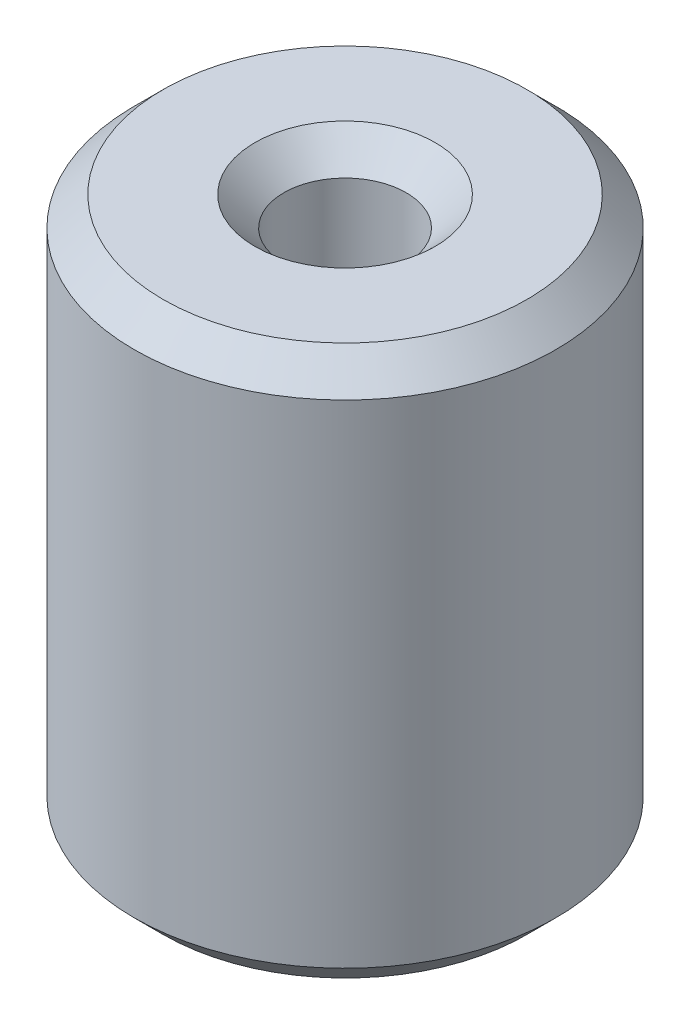
ISO-10303-21;
HEADER;
FILE_DESCRIPTION(('STEP AP214'),'2;1');
FILE_NAME('part.step','',(''),(''),'','','');
FILE_SCHEMA(('AUTOMOTIVE_DESIGN { 1 0 10303 214 1 1 1 1 }'));
ENDSEC;
DATA;
#1=APPLICATION_CONTEXT('core data for automotive mechanical design processes');
#2=APPLICATION_PROTOCOL_DEFINITION('international standard','automotive_design',2000,#1);
#3=PRODUCT_CONTEXT('',#1,'mechanical');
#4=PRODUCT('Part','Part','',(#3));
#5=PRODUCT_RELATED_PRODUCT_CATEGORY('part','',(#4));
#6=PRODUCT_DEFINITION_FORMATION('','',#4);
#7=PRODUCT_DEFINITION_CONTEXT('part definition',#1,'design');
#8=PRODUCT_DEFINITION('design','',#6,#7);
#9=PRODUCT_DEFINITION_SHAPE('','',#8);
#10=(LENGTH_UNIT() NAMED_UNIT(*) SI_UNIT(.MILLI.,.METRE.));
#11=(NAMED_UNIT(*) PLANE_ANGLE_UNIT() SI_UNIT($,.RADIAN.));
#12=(NAMED_UNIT(*) SI_UNIT($,.STERADIAN.) SOLID_ANGLE_UNIT());
#13=UNCERTAINTY_MEASURE_WITH_UNIT(LENGTH_MEASURE(1.E-05),#10,'distance_accuracy_value','');
#14=(GEOMETRIC_REPRESENTATION_CONTEXT(3) GLOBAL_UNCERTAINTY_ASSIGNED_CONTEXT((#13)) GLOBAL_UNIT_ASSIGNED_CONTEXT((#10,
#11,#12)) REPRESENTATION_CONTEXT('',''));
#15=CARTESIAN_POINT('',(0.,0.,0.));
#16=DIRECTION('',(0.,0.,1.));
#17=DIRECTION('',(1.,0.,0.));
#18=AXIS2_PLACEMENT_3D('',#15,#16,#17);
#19=CARTESIAN_POINT('',(0.,13.0423986832514,0.));
#20=DIRECTION('',(0.,-1.,0.));
#21=DIRECTION('',(0.,0.,-1.));
#22=AXIS2_PLACEMENT_3D('',#19,#20,#21);
#23=CYLINDRICAL_SURFACE('',#22,5.);
#24=CARTESIAN_POINT('',(0.,0.68646439729818,0.));
#25=DIRECTION('',(0.,1.,0.));
#26=DIRECTION('',(0.,0.,1.));
#27=AXIS2_PLACEMENT_3D('',#24,#25,#26);
#28=CIRCLE('',#27,5.);
#29=CARTESIAN_POINT('',(0.,0.68646439729818,5.));
#30=VERTEX_POINT('',#29);
#31=EDGE_CURVE('E10',#30,#30,#28,.T.);
#32=ORIENTED_EDGE('',*,*,#31,.T.);
#33=EDGE_LOOP('',(#32));
#34=FACE_BOUND('',#33,.T.);
#35=CARTESIAN_POINT('',(0.,12.3559342859532,0.));
#36=DIRECTION('',(0.,1.,0.));
#37=DIRECTION('',(0.,0.,1.));
#38=AXIS2_PLACEMENT_3D('',#35,#36,#37);
#39=CIRCLE('',#38,5.);
#40=CARTESIAN_POINT('',(0.,12.3559342859532,5.));
#41=VERTEX_POINT('',#40);
#42=EDGE_CURVE('E50',#41,#41,#39,.F.);
#43=ORIENTED_EDGE('',*,*,#42,.T.);
#44=EDGE_LOOP('',(#43));
#45=FACE_BOUND('',#44,.T.);
#46=ADVANCED_FACE('F39',(#34,#45),#23,.T.);
#47=CARTESIAN_POINT('',(0.,13.0423986832514,0.));
#48=DIRECTION('',(0.,1.,0.));
#49=DIRECTION('',(0.,0.,1.));
#50=AXIS2_PLACEMENT_3D('',#47,#48,#49);
#51=PLANE('',#50);
#52=CARTESIAN_POINT('',(0.,13.0423986832514,0.));
#53=DIRECTION('',(0.,1.,0.));
#54=DIRECTION('',(0.,0.,1.));
#55=AXIS2_PLACEMENT_3D('',#52,#53,#54);
#56=CIRCLE('',#55,2.13652480732371);
#57=CARTESIAN_POINT('',(0.,13.0423986832514,2.13652480732371));
#58=VERTEX_POINT('',#57);
#59=EDGE_CURVE('E58',#58,#58,#56,.F.);
#60=ORIENTED_EDGE('',*,*,#59,.T.);
#61=EDGE_LOOP('',(#60));
#62=FACE_BOUND('',#61,.T.);
#63=CARTESIAN_POINT('',(0.,13.0423986832514,0.));
#64=DIRECTION('',(0.,1.,0.));
#65=DIRECTION('',(0.,0.,1.));
#66=AXIS2_PLACEMENT_3D('',#63,#64,#65);
#67=CIRCLE('',#66,4.31353560270182);
#68=CARTESIAN_POINT('',(0.,13.0423986832514,4.31353560270182));
#69=VERTEX_POINT('',#68);
#70=EDGE_CURVE('E61',#69,#69,#67,.T.);
#71=ORIENTED_EDGE('',*,*,#70,.T.);
#72=EDGE_LOOP('',(#71));
#73=FACE_BOUND('',#72,.T.);
#74=ADVANCED_FACE('F88',(#62,#73),#51,.T.);
#75=CARTESIAN_POINT('',(0.,0.,0.));
#76=DIRECTION('',(0.,1.,0.));
#77=DIRECTION('',(0.,0.,1.));
#78=AXIS2_PLACEMENT_3D('',#75,#76,#77);
#79=PLANE('',#78);
#80=CARTESIAN_POINT('',(0.,0.,0.));
#81=DIRECTION('',(0.,1.,0.));
#82=DIRECTION('',(0.,0.,1.));
#83=AXIS2_PLACEMENT_3D('',#80,#81,#82);
#84=CIRCLE('',#83,2.13652480732371);
#85=CARTESIAN_POINT('',(0.,0.,2.13652480732371));
#86=VERTEX_POINT('',#85);
#87=EDGE_CURVE('E51',#86,#86,#84,.T.);
#88=ORIENTED_EDGE('',*,*,#87,.T.);
#89=EDGE_LOOP('',(#88));
#90=FACE_BOUND('',#89,.T.);
#91=CARTESIAN_POINT('',(0.,0.,0.));
#92=DIRECTION('',(0.,1.,0.));
#93=DIRECTION('',(0.,0.,1.));
#94=AXIS2_PLACEMENT_3D('',#91,#92,#93);
#95=CIRCLE('',#94,4.31353560270181);
#96=CARTESIAN_POINT('',(0.,0.,4.31353560270181));
#97=VERTEX_POINT('',#96);
#98=EDGE_CURVE('E54',#97,#97,#95,.F.);
#99=ORIENTED_EDGE('',*,*,#98,.T.);
#100=EDGE_LOOP('',(#99));
#101=FACE_BOUND('',#100,.T.);
#102=ADVANCED_FACE('F83',(#90,#101),#79,.F.);
#103=CARTESIAN_POINT('',(0.,13.0423986832514,0.));
#104=DIRECTION('',(0.,-1.,0.));
#105=DIRECTION('',(0.,0.,-1.));
#106=AXIS2_PLACEMENT_3D('',#103,#104,#105);
#107=CYLINDRICAL_SURFACE('',#106,1.45006041002553);
#108=CARTESIAN_POINT('',(0.,12.3559342859532,0.));
#109=DIRECTION('',(0.,1.,0.));
#110=DIRECTION('',(0.,0.,1.));
#111=AXIS2_PLACEMENT_3D('',#108,#109,#110);
#112=CIRCLE('',#111,1.45006041002553);
#113=CARTESIAN_POINT('',(0.,12.3559342859532,1.45006041002553));
#114=VERTEX_POINT('',#113);
#115=EDGE_CURVE('E67',#114,#114,#112,.T.);
#116=ORIENTED_EDGE('',*,*,#115,.T.);
#117=EDGE_LOOP('',(#116));
#118=FACE_BOUND('',#117,.T.);
#119=CARTESIAN_POINT('',(0.,0.686464397298185,0.));
#120=DIRECTION('',(0.,1.,0.));
#121=DIRECTION('',(0.,0.,1.));
#122=AXIS2_PLACEMENT_3D('',#119,#120,#121);
#123=CIRCLE('',#122,1.45006041002553);
#124=CARTESIAN_POINT('',(0.,0.686464397298185,1.45006041002553));
#125=VERTEX_POINT('',#124);
#126=EDGE_CURVE('E69',#125,#125,#123,.F.);
#127=ORIENTED_EDGE('',*,*,#126,.T.);
#128=EDGE_LOOP('',(#127));
#129=FACE_BOUND('',#128,.T.);
#130=ADVANCED_FACE('F71',(#118,#129),#107,.F.);
#131=CARTESIAN_POINT('',(0.,12.3559342859532,0.));
#132=DIRECTION('',(0.,1.,0.));
#133=DIRECTION('',(0.,0.,1.));
#134=AXIS2_PLACEMENT_3D('',#131,#132,#133);
#135=CONICAL_SURFACE('',#134,1.45006041002553,0.78539816339745);
#136=ORIENTED_EDGE('',*,*,#59,.F.);
#137=EDGE_LOOP('',(#136));
#138=FACE_BOUND('',#137,.T.);
#139=ORIENTED_EDGE('',*,*,#115,.F.);
#140=EDGE_LOOP('',(#139));
#141=FACE_BOUND('',#140,.T.);
#142=ADVANCED_FACE('F77',(#138,#141),#135,.F.);
#143=CARTESIAN_POINT('',(0.,0.,0.));
#144=DIRECTION('',(0.,-1.,0.));
#145=DIRECTION('',(0.,0.,-1.));
#146=AXIS2_PLACEMENT_3D('',#143,#144,#145);
#147=CONICAL_SURFACE('',#146,2.13652480732371,0.785398163397445);
#148=ORIENTED_EDGE('',*,*,#126,.F.);
#149=EDGE_LOOP('',(#148));
#150=FACE_BOUND('',#149,.T.);
#151=ORIENTED_EDGE('',*,*,#87,.F.);
#152=EDGE_LOOP('',(#151));
#153=FACE_BOUND('',#152,.T.);
#154=ADVANCED_FACE('F73',(#150,#153),#147,.F.);
#155=CARTESIAN_POINT('',(0.,0.68646439729818,0.));
#156=DIRECTION('',(0.,1.,0.));
#157=DIRECTION('',(0.,0.,1.));
#158=AXIS2_PLACEMENT_3D('',#155,#156,#157);
#159=CONICAL_SURFACE('',#158,5.,0.785398163397453);
#160=ORIENTED_EDGE('',*,*,#98,.F.);
#161=EDGE_LOOP('',(#160));
#162=FACE_BOUND('',#161,.T.);
#163=ORIENTED_EDGE('',*,*,#31,.F.);
#164=EDGE_LOOP('',(#163));
#165=FACE_BOUND('',#164,.T.);
#166=ADVANCED_FACE('F76',(#162,#165),#159,.T.);
#167=CARTESIAN_POINT('',(0.,13.0423986832514,0.));
#168=DIRECTION('',(0.,-1.,0.));
#169=DIRECTION('',(0.,0.,-1.));
#170=AXIS2_PLACEMENT_3D('',#167,#168,#169);
#171=CONICAL_SURFACE('',#170,4.31353560270182,0.785398163397444);
#172=ORIENTED_EDGE('',*,*,#42,.F.);
#173=EDGE_LOOP('',(#172));
#174=FACE_BOUND('',#173,.T.);
#175=ORIENTED_EDGE('',*,*,#70,.F.);
#176=EDGE_LOOP('',(#175));
#177=FACE_BOUND('',#176,.T.);
#178=ADVANCED_FACE('F45',(#174,#177),#171,.T.);
#179=CLOSED_SHELL('',(#46,#74,#102,#130,#142,#154,#166,#178));
#180=MANIFOLD_SOLID_BREP('B2',#179);
#181=ADVANCED_BREP_SHAPE_REPRESENTATION('',(#18,#180),#14);
#182=SHAPE_DEFINITION_REPRESENTATION(#9,#181);
ENDSEC;
END-ISO-10303-21;
